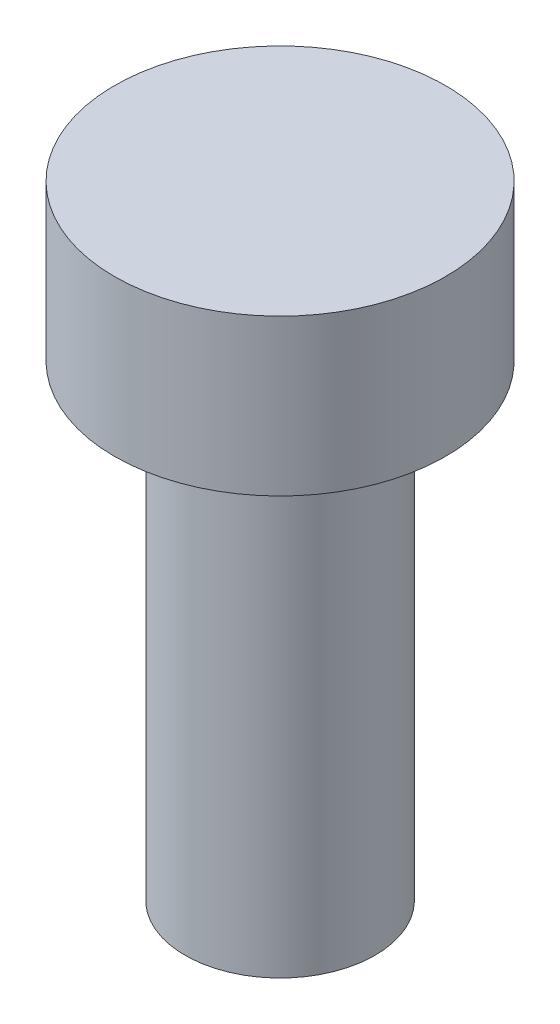
ISO-10303-21;
HEADER;
FILE_DESCRIPTION(('STEP AP214'),'2;1');
FILE_NAME('part.step','',(''),(''),'','','');
FILE_SCHEMA(('AUTOMOTIVE_DESIGN { 1 0 10303 214 1 1 1 1 }'));
ENDSEC;
DATA;
#1=APPLICATION_CONTEXT('core data for automotive mechanical design processes');
#2=APPLICATION_PROTOCOL_DEFINITION('international standard','automotive_design',2000,#1);
#3=PRODUCT_CONTEXT('',#1,'mechanical');
#4=PRODUCT('Part','Part','',(#3));
#5=PRODUCT_RELATED_PRODUCT_CATEGORY('part','',(#4));
#6=PRODUCT_DEFINITION_FORMATION('','',#4);
#7=PRODUCT_DEFINITION_CONTEXT('part definition',#1,'design');
#8=PRODUCT_DEFINITION('design','',#6,#7);
#9=PRODUCT_DEFINITION_SHAPE('','',#8);
#10=(LENGTH_UNIT() NAMED_UNIT(*) SI_UNIT(.MILLI.,.METRE.));
#11=(NAMED_UNIT(*) PLANE_ANGLE_UNIT() SI_UNIT($,.RADIAN.));
#12=(NAMED_UNIT(*) SI_UNIT($,.STERADIAN.) SOLID_ANGLE_UNIT());
#13=UNCERTAINTY_MEASURE_WITH_UNIT(LENGTH_MEASURE(1.E-05),#10,'distance_accuracy_value','');
#14=(GEOMETRIC_REPRESENTATION_CONTEXT(3) GLOBAL_UNCERTAINTY_ASSIGNED_CONTEXT((#13)) GLOBAL_UNIT_ASSIGNED_CONTEXT((#10,
#11,#12)) REPRESENTATION_CONTEXT('',''));
#15=CARTESIAN_POINT('',(0.,0.,0.));
#16=DIRECTION('',(0.,0.,1.));
#17=DIRECTION('',(1.,0.,0.));
#18=AXIS2_PLACEMENT_3D('',#15,#16,#17);
#19=CARTESIAN_POINT('',(0.,4.,0.));
#20=DIRECTION('',(0.,-1.,0.));
#21=DIRECTION('',(0.,0.,-1.));
#22=AXIS2_PLACEMENT_3D('',#19,#20,#21);
#23=CYLINDRICAL_SURFACE('',#22,4.25);
#24=CARTESIAN_POINT('',(0.,4.,0.));
#25=DIRECTION('',(0.,1.,0.));
#26=DIRECTION('',(0.,0.,1.));
#27=AXIS2_PLACEMENT_3D('',#24,#25,#26);
#28=CIRCLE('',#27,4.25);
#29=CARTESIAN_POINT('',(0.,4.,4.25));
#30=VERTEX_POINT('',#29);
#31=EDGE_CURVE('E38',#30,#30,#28,.T.);
#32=ORIENTED_EDGE('',*,*,#31,.F.);
#33=EDGE_LOOP('',(#32));
#34=FACE_BOUND('',#33,.T.);
#35=CARTESIAN_POINT('',(0.,0.,0.));
#36=DIRECTION('',(0.,1.,0.));
#37=DIRECTION('',(0.,0.,1.));
#38=AXIS2_PLACEMENT_3D('',#35,#36,#37);
#39=CIRCLE('',#38,4.25);
#40=CARTESIAN_POINT('',(0.,0.,4.25));
#41=VERTEX_POINT('',#40);
#42=EDGE_CURVE('E34',#41,#41,#39,.T.);
#43=ORIENTED_EDGE('',*,*,#42,.T.);
#44=EDGE_LOOP('',(#43));
#45=FACE_BOUND('',#44,.T.);
#46=ADVANCED_FACE('F31',(#34,#45),#23,.T.);
#47=CARTESIAN_POINT('',(0.,4.,0.));
#48=DIRECTION('',(0.,1.,0.));
#49=DIRECTION('',(0.,0.,1.));
#50=AXIS2_PLACEMENT_3D('',#47,#48,#49);
#51=PLANE('',#50);
#52=ORIENTED_EDGE('',*,*,#31,.T.);
#53=EDGE_LOOP('',(#52));
#54=FACE_BOUND('',#53,.T.);
#55=ADVANCED_FACE('F55',(#54),#51,.T.);
#56=CARTESIAN_POINT('',(0.,0.,0.));
#57=DIRECTION('',(0.,1.,0.));
#58=DIRECTION('',(0.,0.,1.));
#59=AXIS2_PLACEMENT_3D('',#56,#57,#58);
#60=PLANE('',#59);
#61=CARTESIAN_POINT('',(0.,0.,0.));
#62=DIRECTION('',(0.,-1.,0.));
#63=DIRECTION('',(0.,0.,-1.));
#64=AXIS2_PLACEMENT_3D('',#61,#62,#63);
#65=CIRCLE('',#64,2.44);
#66=CARTESIAN_POINT('',(0.,0.,-2.44));
#67=VERTEX_POINT('',#66);
#68=EDGE_CURVE('E10',#67,#67,#65,.T.);
#69=ORIENTED_EDGE('',*,*,#68,.F.);
#70=EDGE_LOOP('',(#69));
#71=FACE_BOUND('',#70,.T.);
#72=ORIENTED_EDGE('',*,*,#42,.F.);
#73=EDGE_LOOP('',(#72));
#74=FACE_BOUND('',#73,.T.);
#75=ADVANCED_FACE('F52',(#71,#74),#60,.F.);
#76=CARTESIAN_POINT('',(0.,-12.,0.));
#77=DIRECTION('',(0.,1.,0.));
#78=DIRECTION('',(0.,0.,1.));
#79=AXIS2_PLACEMENT_3D('',#76,#77,#78);
#80=CYLINDRICAL_SURFACE('',#79,2.44);
#81=CARTESIAN_POINT('',(0.,-12.,0.));
#82=DIRECTION('',(0.,-1.,0.));
#83=DIRECTION('',(0.,0.,-1.));
#84=AXIS2_PLACEMENT_3D('',#81,#82,#83);
#85=CIRCLE('',#84,2.44);
#86=CARTESIAN_POINT('',(0.,-12.,-2.44));
#87=VERTEX_POINT('',#86);
#88=EDGE_CURVE('E44',#87,#87,#85,.T.);
#89=ORIENTED_EDGE('',*,*,#88,.F.);
#90=EDGE_LOOP('',(#89));
#91=FACE_BOUND('',#90,.T.);
#92=ORIENTED_EDGE('',*,*,#68,.T.);
#93=EDGE_LOOP('',(#92));
#94=FACE_BOUND('',#93,.T.);
#95=ADVANCED_FACE('F54',(#91,#94),#80,.T.);
#96=CARTESIAN_POINT('',(0.,-12.,0.));
#97=DIRECTION('',(0.,-1.,0.));
#98=DIRECTION('',(0.,0.,-1.));
#99=AXIS2_PLACEMENT_3D('',#96,#97,#98);
#100=PLANE('',#99);
#101=ORIENTED_EDGE('',*,*,#88,.T.);
#102=EDGE_LOOP('',(#101));
#103=FACE_BOUND('',#102,.T.);
#104=ADVANCED_FACE('F61',(#103),#100,.T.);
#105=CLOSED_SHELL('',(#46,#55,#75,#95,#104));
#106=MANIFOLD_SOLID_BREP('B2',#105);
#107=ADVANCED_BREP_SHAPE_REPRESENTATION('',(#18,#106),#14);
#108=SHAPE_DEFINITION_REPRESENTATION(#9,#107);
ENDSEC;
END-ISO-10303-21;
